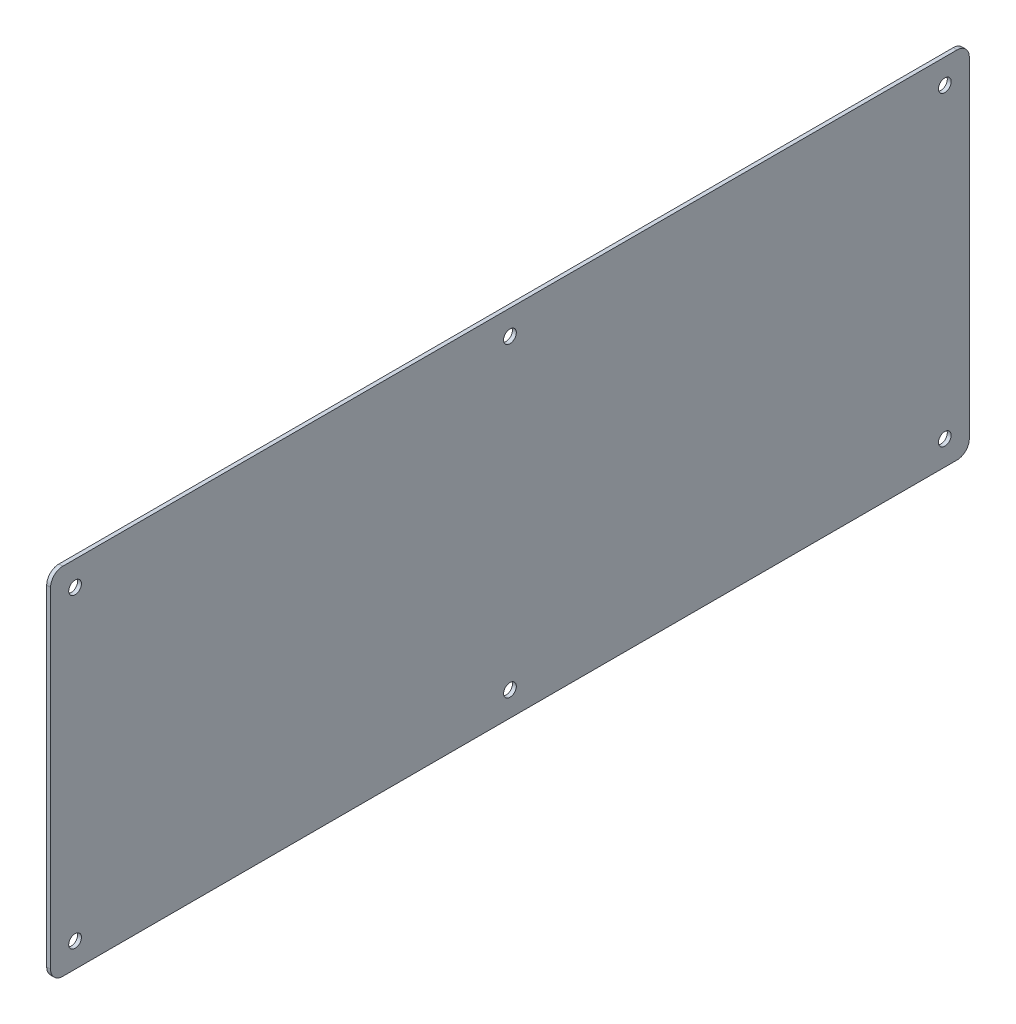
ISO-10303-21;
HEADER;
FILE_DESCRIPTION(('STEP AP214'),'2;1');
FILE_NAME('part.step','',(''),(''),'','','');
FILE_SCHEMA(('AUTOMOTIVE_DESIGN { 1 0 10303 214 1 1 1 1 }'));
ENDSEC;
DATA;
#1=APPLICATION_CONTEXT('core data for automotive mechanical design processes');
#2=APPLICATION_PROTOCOL_DEFINITION('international standard','automotive_design',2000,#1);
#3=PRODUCT_CONTEXT('',#1,'mechanical');
#4=PRODUCT('Part','Part','',(#3));
#5=PRODUCT_RELATED_PRODUCT_CATEGORY('part','',(#4));
#6=PRODUCT_DEFINITION_FORMATION('','',#4);
#7=PRODUCT_DEFINITION_CONTEXT('part definition',#1,'design');
#8=PRODUCT_DEFINITION('design','',#6,#7);
#9=PRODUCT_DEFINITION_SHAPE('','',#8);
#10=(LENGTH_UNIT() NAMED_UNIT(*) SI_UNIT(.MILLI.,.METRE.));
#11=(NAMED_UNIT(*) PLANE_ANGLE_UNIT() SI_UNIT($,.RADIAN.));
#12=(NAMED_UNIT(*) SI_UNIT($,.STERADIAN.) SOLID_ANGLE_UNIT());
#13=UNCERTAINTY_MEASURE_WITH_UNIT(LENGTH_MEASURE(1.E-05),#10,'distance_accuracy_value','');
#14=(GEOMETRIC_REPRESENTATION_CONTEXT(3) GLOBAL_UNCERTAINTY_ASSIGNED_CONTEXT((#13)) GLOBAL_UNIT_ASSIGNED_CONTEXT((#10,
#11,#12)) REPRESENTATION_CONTEXT('',''));
#15=CARTESIAN_POINT('',(0.,0.,0.));
#16=DIRECTION('',(0.,0.,1.));
#17=DIRECTION('',(1.,0.,0.));
#18=AXIS2_PLACEMENT_3D('',#15,#16,#17);
#19=CARTESIAN_POINT('',(101.5773,0.,0.));
#20=DIRECTION('',(1.,0.,0.));
#21=DIRECTION('',(0.,0.,-1.));
#22=AXIS2_PLACEMENT_3D('',#19,#20,#21);
#23=PLANE('',#22);
#24=CARTESIAN_POINT('',(101.5773,62.4948999999999,0.));
#25=DIRECTION('',(1.,0.,0.));
#26=DIRECTION('',(0.,0.,-1.));
#27=AXIS2_PLACEMENT_3D('',#24,#25,#26);
#28=CIRCLE('',#27,2.6);
#29=CARTESIAN_POINT('',(101.5773,62.4948999999999,-2.60000000000008));
#30=VERTEX_POINT('',#29);
#31=EDGE_CURVE('E240',#30,#30,#28,.T.);
#32=ORIENTED_EDGE('',*,*,#31,.F.);
#33=EDGE_LOOP('',(#32));
#34=FACE_BOUND('',#33,.T.);
#35=CARTESIAN_POINT('',(101.5773,-62.4948999999999,-177.5));
#36=DIRECTION('',(1.,0.,0.));
#37=DIRECTION('',(0.,0.,-1.));
#38=AXIS2_PLACEMENT_3D('',#35,#36,#37);
#39=CIRCLE('',#38,2.59999999999999);
#40=CARTESIAN_POINT('',(101.5773,-62.4948999999999,-180.1));
#41=VERTEX_POINT('',#40);
#42=EDGE_CURVE('E224',#41,#41,#39,.T.);
#43=ORIENTED_EDGE('',*,*,#42,.F.);
#44=EDGE_LOOP('',(#43));
#45=FACE_BOUND('',#44,.T.);
#46=CARTESIAN_POINT('',(101.5773,62.4948999999999,177.5));
#47=DIRECTION('',(1.,0.,0.));
#48=DIRECTION('',(0.,0.,-1.));
#49=AXIS2_PLACEMENT_3D('',#46,#47,#48);
#50=CIRCLE('',#49,2.59999999999999);
#51=CARTESIAN_POINT('',(101.5773,62.4948999999999,174.9));
#52=VERTEX_POINT('',#51);
#53=EDGE_CURVE('E203',#52,#52,#50,.T.);
#54=ORIENTED_EDGE('',*,*,#53,.F.);
#55=EDGE_LOOP('',(#54));
#56=FACE_BOUND('',#55,.T.);
#57=DIRECTION('',(0.,0.,-1.));
#58=VECTOR('',#57,1.);
#59=CARTESIAN_POINT('',(101.5773,-72.4898,187.5));
#60=LINE('',#59,#58);
#61=CARTESIAN_POINT('',(101.5773,-72.4898,182.5));
#62=VERTEX_POINT('',#61);
#63=CARTESIAN_POINT('',(101.5773,-72.4898,-182.5));
#64=VERTEX_POINT('',#63);
#65=EDGE_CURVE('E197',#62,#64,#60,.T.);
#66=ORIENTED_EDGE('',*,*,#65,.T.);
#67=CARTESIAN_POINT('',(101.5773,-67.4898,-182.5));
#68=DIRECTION('',(1.,0.,0.));
#69=DIRECTION('',(0.,0.,-1.));
#70=AXIS2_PLACEMENT_3D('',#67,#68,#69);
#71=CIRCLE('',#70,5.);
#72=CARTESIAN_POINT('',(101.5773,-67.4898,-187.5));
#73=VERTEX_POINT('',#72);
#74=EDGE_CURVE('E172',#64,#73,#71,.T.);
#75=ORIENTED_EDGE('',*,*,#74,.T.);
#76=DIRECTION('',(0.,1.,0.));
#77=VECTOR('',#76,1.);
#78=CARTESIAN_POINT('',(101.5773,72.4898,-187.5));
#79=LINE('',#78,#77);
#80=CARTESIAN_POINT('',(101.5773,67.4898,-187.5));
#81=VERTEX_POINT('',#80);
#82=EDGE_CURVE('E128',#73,#81,#79,.T.);
#83=ORIENTED_EDGE('',*,*,#82,.T.);
#84=CARTESIAN_POINT('',(101.5773,67.4898,-182.5));
#85=DIRECTION('',(1.,0.,0.));
#86=DIRECTION('',(0.,0.,-1.));
#87=AXIS2_PLACEMENT_3D('',#84,#85,#86);
#88=CIRCLE('',#87,5.);
#89=CARTESIAN_POINT('',(101.5773,72.4898,-182.5));
#90=VERTEX_POINT('',#89);
#91=EDGE_CURVE('E63',#81,#90,#88,.T.);
#92=ORIENTED_EDGE('',*,*,#91,.T.);
#93=DIRECTION('',(0.,0.,1.));
#94=VECTOR('',#93,1.);
#95=CARTESIAN_POINT('',(101.5773,72.4898,187.5));
#96=LINE('',#95,#94);
#97=CARTESIAN_POINT('',(101.5773,72.4898,182.5));
#98=VERTEX_POINT('',#97);
#99=EDGE_CURVE('E150',#90,#98,#96,.T.);
#100=ORIENTED_EDGE('',*,*,#99,.T.);
#101=CARTESIAN_POINT('',(101.5773,67.4898,182.5));
#102=DIRECTION('',(1.,0.,0.));
#103=DIRECTION('',(0.,0.,-1.));
#104=AXIS2_PLACEMENT_3D('',#101,#102,#103);
#105=CIRCLE('',#104,5.);
#106=CARTESIAN_POINT('',(101.5773,67.4898,187.5));
#107=VERTEX_POINT('',#106);
#108=EDGE_CURVE('E167',#98,#107,#105,.T.);
#109=ORIENTED_EDGE('',*,*,#108,.T.);
#110=DIRECTION('',(0.,-1.,0.));
#111=VECTOR('',#110,1.);
#112=CARTESIAN_POINT('',(101.5773,72.4898,187.5));
#113=LINE('',#112,#111);
#114=CARTESIAN_POINT('',(101.5773,-67.4898,187.5));
#115=VERTEX_POINT('',#114);
#116=EDGE_CURVE('E143',#107,#115,#113,.T.);
#117=ORIENTED_EDGE('',*,*,#116,.T.);
#118=CARTESIAN_POINT('',(101.5773,-67.4898,182.5));
#119=DIRECTION('',(1.,0.,0.));
#120=DIRECTION('',(0.,0.,-1.));
#121=AXIS2_PLACEMENT_3D('',#118,#119,#120);
#122=CIRCLE('',#121,5.);
#123=EDGE_CURVE('E164',#115,#62,#122,.T.);
#124=ORIENTED_EDGE('',*,*,#123,.T.);
#125=EDGE_LOOP('',(#66,#75,#83,#92,#100,#109,#117,#124));
#126=FACE_BOUND('',#125,.T.);
#127=CARTESIAN_POINT('',(101.5773,-62.4948999999999,177.5));
#128=DIRECTION('',(1.,0.,0.));
#129=DIRECTION('',(0.,0.,1.));
#130=AXIS2_PLACEMENT_3D('',#127,#128,#129);
#131=CIRCLE('',#130,2.59999999999999);
#132=CARTESIAN_POINT('',(101.5773,-62.4948999999999,180.1));
#133=VERTEX_POINT('',#132);
#134=EDGE_CURVE('E218',#133,#133,#131,.T.);
#135=ORIENTED_EDGE('',*,*,#134,.F.);
#136=EDGE_LOOP('',(#135));
#137=FACE_BOUND('',#136,.T.);
#138=CARTESIAN_POINT('',(101.5773,62.4948999999999,-177.5));
#139=DIRECTION('',(1.,0.,0.));
#140=DIRECTION('',(0.,0.,1.));
#141=AXIS2_PLACEMENT_3D('',#138,#139,#140);
#142=CIRCLE('',#141,2.59999999999999);
#143=CARTESIAN_POINT('',(101.5773,62.4948999999999,-174.9));
#144=VERTEX_POINT('',#143);
#145=EDGE_CURVE('E232',#144,#144,#142,.T.);
#146=ORIENTED_EDGE('',*,*,#145,.F.);
#147=EDGE_LOOP('',(#146));
#148=FACE_BOUND('',#147,.T.);
#149=CARTESIAN_POINT('',(101.5773,-62.4948999999999,0.));
#150=DIRECTION('',(1.,0.,0.));
#151=DIRECTION('',(0.,0.,-1.));
#152=AXIS2_PLACEMENT_3D('',#149,#150,#151);
#153=CIRCLE('',#152,2.6);
#154=CARTESIAN_POINT('',(101.5773,-62.4948999999999,-2.60000000000007));
#155=VERTEX_POINT('',#154);
#156=EDGE_CURVE('E248',#155,#155,#153,.T.);
#157=ORIENTED_EDGE('',*,*,#156,.F.);
#158=EDGE_LOOP('',(#157));
#159=FACE_BOUND('',#158,.T.);
#160=ADVANCED_FACE('F40',(#34,#45,#56,#126,#137,#148,#159),#23,.T.);
#161=CARTESIAN_POINT('',(99.9897999999998,0.,0.));
#162=DIRECTION('',(1.,0.,0.));
#163=DIRECTION('',(0.,0.,-1.));
#164=AXIS2_PLACEMENT_3D('',#161,#162,#163);
#165=PLANE('',#164);
#166=DIRECTION('',(0.,1.,0.));
#167=VECTOR('',#166,1.);
#168=CARTESIAN_POINT('',(99.9897999999997,72.4898,-187.5));
#169=LINE('',#168,#167);
#170=CARTESIAN_POINT('',(99.9897999999997,-67.4898,-187.5));
#171=VERTEX_POINT('',#170);
#172=CARTESIAN_POINT('',(99.9897999999997,67.4898,-187.5));
#173=VERTEX_POINT('',#172);
#174=EDGE_CURVE('E126',#171,#173,#169,.T.);
#175=ORIENTED_EDGE('',*,*,#174,.F.);
#176=CARTESIAN_POINT('',(99.9897999999997,-67.4898,-182.5));
#177=DIRECTION('',(1.,0.,0.));
#178=DIRECTION('',(0.,0.,-1.));
#179=AXIS2_PLACEMENT_3D('',#176,#177,#178);
#180=CIRCLE('',#179,5.);
#181=CARTESIAN_POINT('',(99.9897999999997,-72.4898,-182.5));
#182=VERTEX_POINT('',#181);
#183=EDGE_CURVE('E108',#171,#182,#180,.F.);
#184=ORIENTED_EDGE('',*,*,#183,.T.);
#185=DIRECTION('',(0.,0.,-1.));
#186=VECTOR('',#185,1.);
#187=CARTESIAN_POINT('',(99.9898,-72.4898,187.5));
#188=LINE('',#187,#186);
#189=CARTESIAN_POINT('',(99.9898,-72.4898,182.5));
#190=VERTEX_POINT('',#189);
#191=EDGE_CURVE('E138',#190,#182,#188,.T.);
#192=ORIENTED_EDGE('',*,*,#191,.F.);
#193=CARTESIAN_POINT('',(99.9898,-67.4898,182.5));
#194=DIRECTION('',(1.,0.,0.));
#195=DIRECTION('',(0.,0.,-1.));
#196=AXIS2_PLACEMENT_3D('',#193,#194,#195);
#197=CIRCLE('',#196,5.);
#198=CARTESIAN_POINT('',(99.9898,-67.4898,187.5));
#199=VERTEX_POINT('',#198);
#200=EDGE_CURVE('E130',#190,#199,#197,.F.);
#201=ORIENTED_EDGE('',*,*,#200,.T.);
#202=DIRECTION('',(0.,-1.,0.));
#203=VECTOR('',#202,1.);
#204=CARTESIAN_POINT('',(99.9897999999999,72.4898,187.5));
#205=LINE('',#204,#203);
#206=CARTESIAN_POINT('',(99.9897999999999,67.4898,187.5));
#207=VERTEX_POINT('',#206);
#208=EDGE_CURVE('E145',#207,#199,#205,.T.);
#209=ORIENTED_EDGE('',*,*,#208,.F.);
#210=CARTESIAN_POINT('',(99.9897999999999,67.4898,182.5));
#211=DIRECTION('',(1.,0.,0.));
#212=DIRECTION('',(0.,0.,-1.));
#213=AXIS2_PLACEMENT_3D('',#210,#211,#212);
#214=CIRCLE('',#213,5.);
#215=CARTESIAN_POINT('',(99.9897999999999,72.4898,182.5));
#216=VERTEX_POINT('',#215);
#217=EDGE_CURVE('E154',#207,#216,#214,.F.);
#218=ORIENTED_EDGE('',*,*,#217,.T.);
#219=DIRECTION('',(0.,0.,1.));
#220=VECTOR('',#219,1.);
#221=CARTESIAN_POINT('',(99.9897999999999,72.4898,187.5));
#222=LINE('',#221,#220);
#223=CARTESIAN_POINT('',(99.9897999999997,72.4898,-182.5));
#224=VERTEX_POINT('',#223);
#225=EDGE_CURVE('E137',#224,#216,#222,.T.);
#226=ORIENTED_EDGE('',*,*,#225,.F.);
#227=CARTESIAN_POINT('',(99.9897999999997,67.4898,-182.5));
#228=DIRECTION('',(1.,0.,0.));
#229=DIRECTION('',(0.,0.,-1.));
#230=AXIS2_PLACEMENT_3D('',#227,#228,#229);
#231=CIRCLE('',#230,5.);
#232=EDGE_CURVE('E120',#224,#173,#231,.F.);
#233=ORIENTED_EDGE('',*,*,#232,.T.);
#234=EDGE_LOOP('',(#175,#184,#192,#201,#209,#218,#226,#233));
#235=FACE_BOUND('',#234,.T.);
#236=CARTESIAN_POINT('',(99.9897999999999,62.4948999999999,177.5));
#237=DIRECTION('',(1.,0.,0.));
#238=DIRECTION('',(0.,0.,-1.));
#239=AXIS2_PLACEMENT_3D('',#236,#237,#238);
#240=CIRCLE('',#239,2.59999999999999);
#241=CARTESIAN_POINT('',(99.9897999999999,62.4948999999999,174.9));
#242=VERTEX_POINT('',#241);
#243=EDGE_CURVE('E207',#242,#242,#240,.T.);
#244=ORIENTED_EDGE('',*,*,#243,.T.);
#245=EDGE_LOOP('',(#244));
#246=FACE_BOUND('',#245,.T.);
#247=CARTESIAN_POINT('',(99.9898,-62.4948999999999,177.5));
#248=DIRECTION('',(1.,0.,0.));
#249=DIRECTION('',(0.,0.,1.));
#250=AXIS2_PLACEMENT_3D('',#247,#248,#249);
#251=CIRCLE('',#250,2.59999999999999);
#252=CARTESIAN_POINT('',(99.9898,-62.4948999999999,180.1));
#253=VERTEX_POINT('',#252);
#254=EDGE_CURVE('E220',#253,#253,#251,.T.);
#255=ORIENTED_EDGE('',*,*,#254,.T.);
#256=EDGE_LOOP('',(#255));
#257=FACE_BOUND('',#256,.T.);
#258=CARTESIAN_POINT('',(99.9897999999997,-62.4948999999999,-177.5));
#259=DIRECTION('',(1.,0.,0.));
#260=DIRECTION('',(0.,0.,-1.));
#261=AXIS2_PLACEMENT_3D('',#258,#259,#260);
#262=CIRCLE('',#261,2.59999999999999);
#263=CARTESIAN_POINT('',(99.9897999999997,-62.4948999999999,-180.1));
#264=VERTEX_POINT('',#263);
#265=EDGE_CURVE('E228',#264,#264,#262,.T.);
#266=ORIENTED_EDGE('',*,*,#265,.T.);
#267=EDGE_LOOP('',(#266));
#268=FACE_BOUND('',#267,.T.);
#269=CARTESIAN_POINT('',(99.9897999999997,62.4948999999999,-177.5));
#270=DIRECTION('',(1.,0.,0.));
#271=DIRECTION('',(0.,0.,1.));
#272=AXIS2_PLACEMENT_3D('',#269,#270,#271);
#273=CIRCLE('',#272,2.59999999999999);
#274=CARTESIAN_POINT('',(99.9897999999997,62.4948999999999,-174.9));
#275=VERTEX_POINT('',#274);
#276=EDGE_CURVE('E236',#275,#275,#273,.T.);
#277=ORIENTED_EDGE('',*,*,#276,.T.);
#278=EDGE_LOOP('',(#277));
#279=FACE_BOUND('',#278,.T.);
#280=CARTESIAN_POINT('',(99.9897999999998,62.4948999999999,0.));
#281=DIRECTION('',(1.,0.,0.));
#282=DIRECTION('',(0.,0.,-1.));
#283=AXIS2_PLACEMENT_3D('',#280,#281,#282);
#284=CIRCLE('',#283,2.6);
#285=CARTESIAN_POINT('',(99.9897999999998,62.4948999999999,-2.60000000000008));
#286=VERTEX_POINT('',#285);
#287=EDGE_CURVE('E244',#286,#286,#284,.T.);
#288=ORIENTED_EDGE('',*,*,#287,.T.);
#289=EDGE_LOOP('',(#288));
#290=FACE_BOUND('',#289,.T.);
#291=CARTESIAN_POINT('',(99.9897999999998,-62.4948999999999,0.));
#292=DIRECTION('',(1.,0.,0.));
#293=DIRECTION('',(0.,0.,-1.));
#294=AXIS2_PLACEMENT_3D('',#291,#292,#293);
#295=CIRCLE('',#294,2.6);
#296=CARTESIAN_POINT('',(99.9897999999998,-62.4948999999999,-2.60000000000007));
#297=VERTEX_POINT('',#296);
#298=EDGE_CURVE('E252',#297,#297,#295,.T.);
#299=ORIENTED_EDGE('',*,*,#298,.T.);
#300=EDGE_LOOP('',(#299));
#301=FACE_BOUND('',#300,.T.);
#302=ADVANCED_FACE('F133',(#235,#246,#257,#268,#279,#290,#301),#165,.F.);
#303=CARTESIAN_POINT('',(101.5773,72.4898,187.5));
#304=DIRECTION('',(0.,0.,-1.));
#305=DIRECTION('',(-1.,0.,0.));
#306=AXIS2_PLACEMENT_3D('',#303,#304,#305);
#307=PLANE('',#306);
#308=ORIENTED_EDGE('',*,*,#116,.F.);
#309=DIRECTION('',(-1.,0.,0.));
#310=VECTOR('',#309,1.);
#311=CARTESIAN_POINT('',(101.5773,67.4898,187.5));
#312=LINE('',#311,#310);
#313=EDGE_CURVE('E11',#107,#207,#312,.T.);
#314=ORIENTED_EDGE('',*,*,#313,.T.);
#315=ORIENTED_EDGE('',*,*,#208,.T.);
#316=DIRECTION('',(-1.,0.,0.));
#317=VECTOR('',#316,1.);
#318=CARTESIAN_POINT('',(101.5773,-67.4898,187.5));
#319=LINE('',#318,#317);
#320=EDGE_CURVE('E49',#199,#115,#319,.F.);
#321=ORIENTED_EDGE('',*,*,#320,.T.);
#322=EDGE_LOOP('',(#308,#314,#315,#321));
#323=FACE_BOUND('',#322,.T.);
#324=ADVANCED_FACE('F187',(#323),#307,.F.);
#325=CARTESIAN_POINT('',(101.5773,-72.4898,187.5));
#326=DIRECTION('',(0.,1.,0.));
#327=DIRECTION('',(-1.,0.,0.));
#328=AXIS2_PLACEMENT_3D('',#325,#326,#327);
#329=PLANE('',#328);
#330=ORIENTED_EDGE('',*,*,#191,.T.);
#331=DIRECTION('',(-1.,0.,0.));
#332=VECTOR('',#331,1.);
#333=CARTESIAN_POINT('',(101.5773,-72.4898,-182.5));
#334=LINE('',#333,#332);
#335=EDGE_CURVE('E113',#182,#64,#334,.F.);
#336=ORIENTED_EDGE('',*,*,#335,.T.);
#337=ORIENTED_EDGE('',*,*,#65,.F.);
#338=DIRECTION('',(-1.,0.,0.));
#339=VECTOR('',#338,1.);
#340=CARTESIAN_POINT('',(101.5773,-72.4898,182.5));
#341=LINE('',#340,#339);
#342=EDGE_CURVE('E119',#62,#190,#341,.T.);
#343=ORIENTED_EDGE('',*,*,#342,.T.);
#344=EDGE_LOOP('',(#330,#336,#337,#343));
#345=FACE_BOUND('',#344,.T.);
#346=ADVANCED_FACE('F201',(#345),#329,.F.);
#347=CARTESIAN_POINT('',(101.5773,72.4898,-187.5));
#348=DIRECTION('',(0.,0.,1.));
#349=DIRECTION('',(1.,0.,0.));
#350=AXIS2_PLACEMENT_3D('',#347,#348,#349);
#351=PLANE('',#350);
#352=ORIENTED_EDGE('',*,*,#82,.F.);
#353=DIRECTION('',(-1.,0.,0.));
#354=VECTOR('',#353,1.);
#355=CARTESIAN_POINT('',(101.5773,-67.4898,-187.5));
#356=LINE('',#355,#354);
#357=EDGE_CURVE('E112',#73,#171,#356,.T.);
#358=ORIENTED_EDGE('',*,*,#357,.T.);
#359=ORIENTED_EDGE('',*,*,#174,.T.);
#360=DIRECTION('',(-1.,0.,0.));
#361=VECTOR('',#360,1.);
#362=CARTESIAN_POINT('',(101.5773,67.4898,-187.5));
#363=LINE('',#362,#361);
#364=EDGE_CURVE('E131',#173,#81,#363,.F.);
#365=ORIENTED_EDGE('',*,*,#364,.T.);
#366=EDGE_LOOP('',(#352,#358,#359,#365));
#367=FACE_BOUND('',#366,.T.);
#368=ADVANCED_FACE('F125',(#367),#351,.F.);
#369=CARTESIAN_POINT('',(101.5773,72.4898,187.5));
#370=DIRECTION('',(0.,-1.,0.));
#371=DIRECTION('',(1.,0.,0.));
#372=AXIS2_PLACEMENT_3D('',#369,#370,#371);
#373=PLANE('',#372);
#374=ORIENTED_EDGE('',*,*,#99,.F.);
#375=DIRECTION('',(-1.,0.,0.));
#376=VECTOR('',#375,1.);
#377=CARTESIAN_POINT('',(101.5773,72.4898,-182.5));
#378=LINE('',#377,#376);
#379=EDGE_CURVE('E177',#90,#224,#378,.T.);
#380=ORIENTED_EDGE('',*,*,#379,.T.);
#381=ORIENTED_EDGE('',*,*,#225,.T.);
#382=DIRECTION('',(-1.,0.,0.));
#383=VECTOR('',#382,1.);
#384=CARTESIAN_POINT('',(101.5773,72.4898,182.5));
#385=LINE('',#384,#383);
#386=EDGE_CURVE('E56',#216,#98,#385,.F.);
#387=ORIENTED_EDGE('',*,*,#386,.T.);
#388=EDGE_LOOP('',(#374,#380,#381,#387));
#389=FACE_BOUND('',#388,.T.);
#390=ADVANCED_FACE('F277',(#389),#373,.F.);
#391=CARTESIAN_POINT('',(101.5773,62.4948999999999,177.5));
#392=DIRECTION('',(-1.,0.,0.));
#393=DIRECTION('',(0.,0.,1.));
#394=AXIS2_PLACEMENT_3D('',#391,#392,#393);
#395=CYLINDRICAL_SURFACE('',#394,2.59999999999999);
#396=ORIENTED_EDGE('',*,*,#53,.T.);
#397=EDGE_LOOP('',(#396));
#398=FACE_BOUND('',#397,.T.);
#399=ORIENTED_EDGE('',*,*,#243,.F.);
#400=EDGE_LOOP('',(#399));
#401=FACE_BOUND('',#400,.T.);
#402=ADVANCED_FACE('F274',(#398,#401),#395,.F.);
#403=CARTESIAN_POINT('',(101.5773,-62.4948999999999,177.5));
#404=DIRECTION('',(-1.,0.,0.));
#405=DIRECTION('',(0.,0.,1.));
#406=AXIS2_PLACEMENT_3D('',#403,#404,#405);
#407=CYLINDRICAL_SURFACE('',#406,2.59999999999999);
#408=ORIENTED_EDGE('',*,*,#134,.T.);
#409=EDGE_LOOP('',(#408));
#410=FACE_BOUND('',#409,.T.);
#411=ORIENTED_EDGE('',*,*,#254,.F.);
#412=EDGE_LOOP('',(#411));
#413=FACE_BOUND('',#412,.T.);
#414=ADVANCED_FACE('F355',(#410,#413),#407,.F.);
#415=CARTESIAN_POINT('',(101.5773,-62.4948999999999,-177.5));
#416=DIRECTION('',(-1.,0.,0.));
#417=DIRECTION('',(0.,0.,1.));
#418=AXIS2_PLACEMENT_3D('',#415,#416,#417);
#419=CYLINDRICAL_SURFACE('',#418,2.59999999999999);
#420=ORIENTED_EDGE('',*,*,#42,.T.);
#421=EDGE_LOOP('',(#420));
#422=FACE_BOUND('',#421,.T.);
#423=ORIENTED_EDGE('',*,*,#265,.F.);
#424=EDGE_LOOP('',(#423));
#425=FACE_BOUND('',#424,.T.);
#426=ADVANCED_FACE('F345',(#422,#425),#419,.F.);
#427=CARTESIAN_POINT('',(101.5773,62.4948999999999,-177.5));
#428=DIRECTION('',(-1.,0.,0.));
#429=DIRECTION('',(0.,0.,1.));
#430=AXIS2_PLACEMENT_3D('',#427,#428,#429);
#431=CYLINDRICAL_SURFACE('',#430,2.59999999999999);
#432=ORIENTED_EDGE('',*,*,#145,.T.);
#433=EDGE_LOOP('',(#432));
#434=FACE_BOUND('',#433,.T.);
#435=ORIENTED_EDGE('',*,*,#276,.F.);
#436=EDGE_LOOP('',(#435));
#437=FACE_BOUND('',#436,.T.);
#438=ADVANCED_FACE('F335',(#434,#437),#431,.F.);
#439=CARTESIAN_POINT('',(101.5773,62.4948999999999,0.));
#440=DIRECTION('',(-1.,0.,0.));
#441=DIRECTION('',(0.,0.,1.));
#442=AXIS2_PLACEMENT_3D('',#439,#440,#441);
#443=CYLINDRICAL_SURFACE('',#442,2.6);
#444=ORIENTED_EDGE('',*,*,#31,.T.);
#445=EDGE_LOOP('',(#444));
#446=FACE_BOUND('',#445,.T.);
#447=ORIENTED_EDGE('',*,*,#287,.F.);
#448=EDGE_LOOP('',(#447));
#449=FACE_BOUND('',#448,.T.);
#450=ADVANCED_FACE('F325',(#446,#449),#443,.F.);
#451=CARTESIAN_POINT('',(101.5773,-62.4948999999999,0.));
#452=DIRECTION('',(-1.,0.,0.));
#453=DIRECTION('',(0.,0.,1.));
#454=AXIS2_PLACEMENT_3D('',#451,#452,#453);
#455=CYLINDRICAL_SURFACE('',#454,2.6);
#456=ORIENTED_EDGE('',*,*,#156,.T.);
#457=EDGE_LOOP('',(#456));
#458=FACE_BOUND('',#457,.T.);
#459=ORIENTED_EDGE('',*,*,#298,.F.);
#460=EDGE_LOOP('',(#459));
#461=FACE_BOUND('',#460,.T.);
#462=ADVANCED_FACE('F261',(#458,#461),#455,.F.);
#463=CARTESIAN_POINT('',(101.5773,-67.4898,-182.5));
#464=DIRECTION('',(-1.,0.,0.));
#465=DIRECTION('',(0.,0.,1.));
#466=AXIS2_PLACEMENT_3D('',#463,#464,#465);
#467=CYLINDRICAL_SURFACE('',#466,5.);
#468=ORIENTED_EDGE('',*,*,#74,.F.);
#469=ORIENTED_EDGE('',*,*,#335,.F.);
#470=ORIENTED_EDGE('',*,*,#183,.F.);
#471=ORIENTED_EDGE('',*,*,#357,.F.);
#472=EDGE_LOOP('',(#468,#469,#470,#471));
#473=FACE_BOUND('',#472,.T.);
#474=ADVANCED_FACE('F111',(#473),#467,.T.);
#475=CARTESIAN_POINT('',(101.5773,67.4898,-182.5));
#476=DIRECTION('',(-1.,0.,0.));
#477=DIRECTION('',(0.,0.,1.));
#478=AXIS2_PLACEMENT_3D('',#475,#476,#477);
#479=CYLINDRICAL_SURFACE('',#478,5.);
#480=ORIENTED_EDGE('',*,*,#91,.F.);
#481=ORIENTED_EDGE('',*,*,#364,.F.);
#482=ORIENTED_EDGE('',*,*,#232,.F.);
#483=ORIENTED_EDGE('',*,*,#379,.F.);
#484=EDGE_LOOP('',(#480,#481,#482,#483));
#485=FACE_BOUND('',#484,.T.);
#486=ADVANCED_FACE('F288',(#485),#479,.T.);
#487=CARTESIAN_POINT('',(101.5773,67.4898,182.5));
#488=DIRECTION('',(-1.,0.,0.));
#489=DIRECTION('',(0.,0.,1.));
#490=AXIS2_PLACEMENT_3D('',#487,#488,#489);
#491=CYLINDRICAL_SURFACE('',#490,5.);
#492=ORIENTED_EDGE('',*,*,#108,.F.);
#493=ORIENTED_EDGE('',*,*,#386,.F.);
#494=ORIENTED_EDGE('',*,*,#217,.F.);
#495=ORIENTED_EDGE('',*,*,#313,.F.);
#496=EDGE_LOOP('',(#492,#493,#494,#495));
#497=FACE_BOUND('',#496,.T.);
#498=ADVANCED_FACE('F290',(#497),#491,.T.);
#499=CARTESIAN_POINT('',(101.5773,-67.4898,182.5));
#500=DIRECTION('',(-1.,0.,0.));
#501=DIRECTION('',(0.,0.,1.));
#502=AXIS2_PLACEMENT_3D('',#499,#500,#501);
#503=CYLINDRICAL_SURFACE('',#502,5.);
#504=ORIENTED_EDGE('',*,*,#123,.F.);
#505=ORIENTED_EDGE('',*,*,#320,.F.);
#506=ORIENTED_EDGE('',*,*,#200,.F.);
#507=ORIENTED_EDGE('',*,*,#342,.F.);
#508=EDGE_LOOP('',(#504,#505,#506,#507));
#509=FACE_BOUND('',#508,.T.);
#510=ADVANCED_FACE('F42',(#509),#503,.T.);
#511=CLOSED_SHELL('',(#160,#302,#324,#346,#368,#390,#402,#414,#426,#438,#450,#462,#474,#486,
#498,#510));
#512=MANIFOLD_SOLID_BREP('B2',#511);
#513=ADVANCED_BREP_SHAPE_REPRESENTATION('',(#18,#512),#14);
#514=SHAPE_DEFINITION_REPRESENTATION(#9,#513);
ENDSEC;
END-ISO-10303-21;
